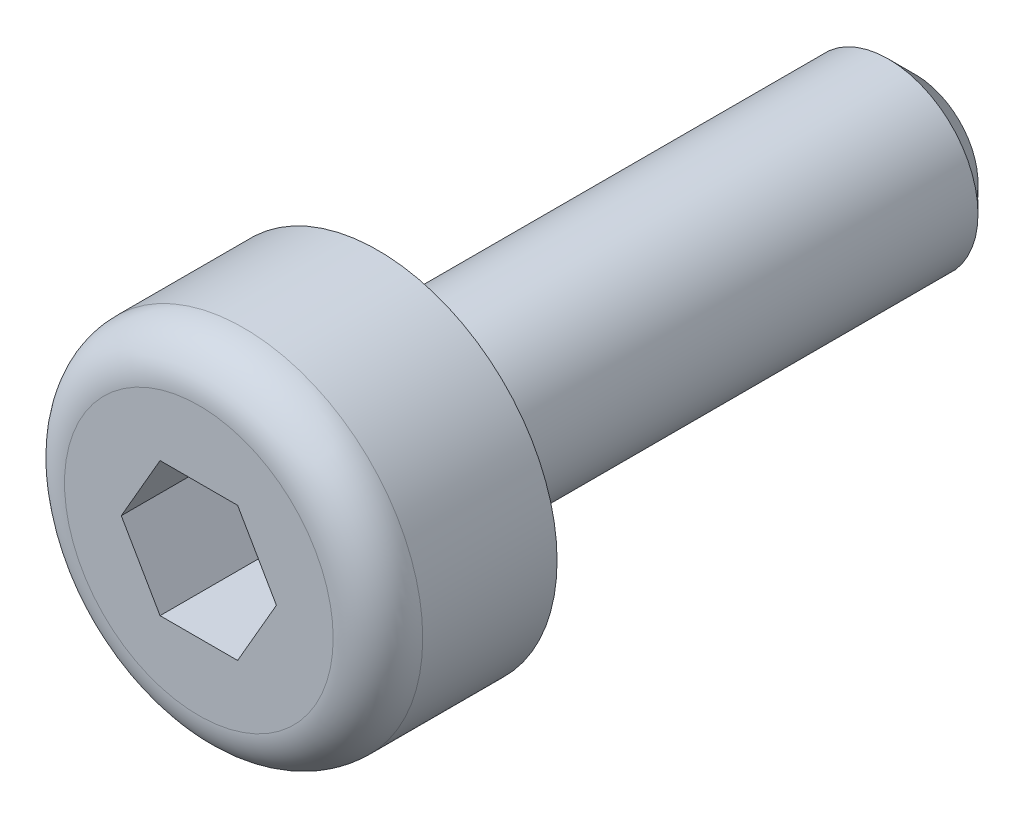
ISO-10303-21;
HEADER;
FILE_DESCRIPTION(('STEP AP214'),'2;1');
FILE_NAME('part.step','',(''),(''),'','','');
FILE_SCHEMA(('AUTOMOTIVE_DESIGN { 1 0 10303 214 1 1 1 1 }'));
ENDSEC;
DATA;
#1=APPLICATION_CONTEXT('core data for automotive mechanical design processes');
#2=APPLICATION_PROTOCOL_DEFINITION('international standard','automotive_design',2000,#1);
#3=PRODUCT_CONTEXT('',#1,'mechanical');
#4=PRODUCT('Part','Part','',(#3));
#5=PRODUCT_RELATED_PRODUCT_CATEGORY('part','',(#4));
#6=PRODUCT_DEFINITION_FORMATION('','',#4);
#7=PRODUCT_DEFINITION_CONTEXT('part definition',#1,'design');
#8=PRODUCT_DEFINITION('design','',#6,#7);
#9=PRODUCT_DEFINITION_SHAPE('','',#8);
#10=(LENGTH_UNIT() NAMED_UNIT(*) SI_UNIT(.MILLI.,.METRE.));
#11=(NAMED_UNIT(*) PLANE_ANGLE_UNIT() SI_UNIT($,.RADIAN.));
#12=(NAMED_UNIT(*) SI_UNIT($,.STERADIAN.) SOLID_ANGLE_UNIT());
#13=UNCERTAINTY_MEASURE_WITH_UNIT(LENGTH_MEASURE(1.E-05),#10,'distance_accuracy_value','');
#14=(GEOMETRIC_REPRESENTATION_CONTEXT(3) GLOBAL_UNCERTAINTY_ASSIGNED_CONTEXT((#13)) GLOBAL_UNIT_ASSIGNED_CONTEXT((#10,
#11,#12)) REPRESENTATION_CONTEXT('',''));
#15=CARTESIAN_POINT('',(0.,0.,0.));
#16=DIRECTION('',(0.,0.,1.));
#17=DIRECTION('',(1.,0.,0.));
#18=AXIS2_PLACEMENT_3D('',#15,#16,#17);
#19=CARTESIAN_POINT('',(0.,0.,0.));
#20=DIRECTION('',(0.,0.,1.));
#21=DIRECTION('',(1.,0.,0.));
#22=AXIS2_PLACEMENT_3D('',#19,#20,#21);
#23=PLANE('',#22);
#24=CARTESIAN_POINT('',(0.,0.,0.));
#25=DIRECTION('',(0.,0.,1.));
#26=DIRECTION('',(1.,0.,0.));
#27=AXIS2_PLACEMENT_3D('',#24,#25,#26);
#28=CIRCLE('',#27,2.);
#29=CARTESIAN_POINT('',(2.,0.,0.));
#30=VERTEX_POINT('',#29);
#31=EDGE_CURVE('E138',#30,#30,#28,.T.);
#32=ORIENTED_EDGE('',*,*,#31,.F.);
#33=EDGE_LOOP('',(#32));
#34=FACE_BOUND('',#33,.T.);
#35=CARTESIAN_POINT('',(0.,0.,0.));
#36=DIRECTION('',(0.,0.,1.));
#37=DIRECTION('',(1.,0.,0.));
#38=AXIS2_PLACEMENT_3D('',#35,#36,#37);
#39=CIRCLE('',#38,1.);
#40=CARTESIAN_POINT('',(1.,0.,0.));
#41=VERTEX_POINT('',#40);
#42=EDGE_CURVE('E146',#41,#41,#39,.F.);
#43=ORIENTED_EDGE('',*,*,#42,.F.);
#44=EDGE_LOOP('',(#43));
#45=FACE_BOUND('',#44,.T.);
#46=ADVANCED_FACE('F38',(#34,#45),#23,.F.);
#47=CARTESIAN_POINT('',(0.,0.,2.));
#48=DIRECTION('',(0.,0.,-1.));
#49=DIRECTION('',(-1.,0.,0.));
#50=AXIS2_PLACEMENT_3D('',#47,#48,#49);
#51=CYLINDRICAL_SURFACE('',#50,2.);
#52=CARTESIAN_POINT('',(0.,0.,1.5));
#53=DIRECTION('',(0.,0.,1.));
#54=DIRECTION('',(1.,0.,0.));
#55=AXIS2_PLACEMENT_3D('',#52,#53,#54);
#56=CIRCLE('',#55,2.);
#57=CARTESIAN_POINT('',(2.,0.,1.5));
#58=VERTEX_POINT('',#57);
#59=EDGE_CURVE('E11',#58,#58,#56,.F.);
#60=ORIENTED_EDGE('',*,*,#59,.T.);
#61=EDGE_LOOP('',(#60));
#62=FACE_BOUND('',#61,.T.);
#63=ORIENTED_EDGE('',*,*,#31,.T.);
#64=EDGE_LOOP('',(#63));
#65=FACE_BOUND('',#64,.T.);
#66=ADVANCED_FACE('F170',(#62,#65),#51,.T.);
#67=CARTESIAN_POINT('',(0.,0.,2.));
#68=DIRECTION('',(0.,0.,1.));
#69=DIRECTION('',(1.,0.,0.));
#70=AXIS2_PLACEMENT_3D('',#67,#68,#69);
#71=PLANE('',#70);
#72=CARTESIAN_POINT('',(0.,0.,2.));
#73=DIRECTION('',(0.,0.,1.));
#74=DIRECTION('',(1.,0.,0.));
#75=AXIS2_PLACEMENT_3D('',#72,#73,#74);
#76=CIRCLE('',#75,1.5);
#77=CARTESIAN_POINT('',(1.5,0.,2.));
#78=VERTEX_POINT('',#77);
#79=EDGE_CURVE('E46',#78,#78,#76,.T.);
#80=ORIENTED_EDGE('',*,*,#79,.T.);
#81=EDGE_LOOP('',(#80));
#82=FACE_BOUND('',#81,.T.);
#83=DIRECTION('',(-0.5,-0.866025403784439,0.));
#84=VECTOR('',#83,1.);
#85=CARTESIAN_POINT('',(-0.433012701892219,0.75,2.));
#86=LINE('',#85,#84);
#87=CARTESIAN_POINT('',(-0.433012701892219,0.75,2.));
#88=VERTEX_POINT('',#87);
#89=CARTESIAN_POINT('',(-0.866025403784438,0.,2.));
#90=VERTEX_POINT('',#89);
#91=EDGE_CURVE('E53',#88,#90,#86,.T.);
#92=ORIENTED_EDGE('',*,*,#91,.F.);
#93=DIRECTION('',(-1.,0.,0.));
#94=VECTOR('',#93,1.);
#95=CARTESIAN_POINT('',(0.43301270189222,0.75,2.));
#96=LINE('',#95,#94);
#97=CARTESIAN_POINT('',(0.43301270189222,0.75,2.));
#98=VERTEX_POINT('',#97);
#99=EDGE_CURVE('E134',#98,#88,#96,.T.);
#100=ORIENTED_EDGE('',*,*,#99,.F.);
#101=DIRECTION('',(-0.5,0.866025403784439,0.));
#102=VECTOR('',#101,1.);
#103=CARTESIAN_POINT('',(0.866025403784439,0.,2.));
#104=LINE('',#103,#102);
#105=CARTESIAN_POINT('',(0.866025403784439,0.,2.));
#106=VERTEX_POINT('',#105);
#107=EDGE_CURVE('E132',#106,#98,#104,.T.);
#108=ORIENTED_EDGE('',*,*,#107,.F.);
#109=DIRECTION('',(0.5,0.866025403784439,0.));
#110=VECTOR('',#109,1.);
#111=CARTESIAN_POINT('',(0.43301270189222,-0.75,2.));
#112=LINE('',#111,#110);
#113=CARTESIAN_POINT('',(0.43301270189222,-0.75,2.));
#114=VERTEX_POINT('',#113);
#115=EDGE_CURVE('E100',#114,#106,#112,.T.);
#116=ORIENTED_EDGE('',*,*,#115,.F.);
#117=DIRECTION('',(1.,0.,0.));
#118=VECTOR('',#117,1.);
#119=CARTESIAN_POINT('',(-0.43301270189222,-0.75,2.));
#120=LINE('',#119,#118);
#121=CARTESIAN_POINT('',(-0.43301270189222,-0.75,2.));
#122=VERTEX_POINT('',#121);
#123=EDGE_CURVE('E128',#122,#114,#120,.T.);
#124=ORIENTED_EDGE('',*,*,#123,.F.);
#125=DIRECTION('',(0.5,-0.866025403784439,0.));
#126=VECTOR('',#125,1.);
#127=CARTESIAN_POINT('',(-0.866025403784438,0.,2.));
#128=LINE('',#127,#126);
#129=EDGE_CURVE('E125',#90,#122,#128,.T.);
#130=ORIENTED_EDGE('',*,*,#129,.F.);
#131=EDGE_LOOP('',(#92,#100,#108,#116,#124,#130));
#132=FACE_BOUND('',#131,.T.);
#133=ADVANCED_FACE('F157',(#82,#132),#71,.T.);
#134=CARTESIAN_POINT('',(-0.433012701892219,0.75,0.));
#135=DIRECTION('',(-0.866025403784439,0.5,0.));
#136=DIRECTION('',(-0.5,-0.866025403784439,0.));
#137=AXIS2_PLACEMENT_3D('',#134,#135,#136);
#138=PLANE('',#137);
#139=ORIENTED_EDGE('',*,*,#91,.T.);
#140=DIRECTION('',(0.,0.,1.));
#141=VECTOR('',#140,1.);
#142=CARTESIAN_POINT('',(-0.866025403784438,0.,0.));
#143=LINE('',#142,#141);
#144=CARTESIAN_POINT('',(-0.866025403784438,0.,0.));
#145=VERTEX_POINT('',#144);
#146=EDGE_CURVE('E84',#145,#90,#143,.T.);
#147=ORIENTED_EDGE('',*,*,#146,.F.);
#148=DIRECTION('',(-0.5,-0.866025403784439,0.));
#149=VECTOR('',#148,1.);
#150=CARTESIAN_POINT('',(-0.433012701892219,0.75,0.));
#151=LINE('',#150,#149);
#152=CARTESIAN_POINT('',(-0.433012701892219,0.75,0.));
#153=VERTEX_POINT('',#152);
#154=EDGE_CURVE('E136',#153,#145,#151,.T.);
#155=ORIENTED_EDGE('',*,*,#154,.F.);
#156=DIRECTION('',(0.,0.,1.));
#157=VECTOR('',#156,1.);
#158=CARTESIAN_POINT('',(-0.433012701892219,0.75,0.));
#159=LINE('',#158,#157);
#160=EDGE_CURVE('E61',#153,#88,#159,.T.);
#161=ORIENTED_EDGE('',*,*,#160,.T.);
#162=EDGE_LOOP('',(#139,#147,#155,#161));
#163=FACE_BOUND('',#162,.T.);
#164=ADVANCED_FACE('F183',(#163),#138,.F.);
#165=CARTESIAN_POINT('',(0.43301270189222,0.75,0.));
#166=DIRECTION('',(0.,1.,0.));
#167=DIRECTION('',(0.,0.,1.));
#168=AXIS2_PLACEMENT_3D('',#165,#166,#167);
#169=PLANE('',#168);
#170=ORIENTED_EDGE('',*,*,#99,.T.);
#171=ORIENTED_EDGE('',*,*,#160,.F.);
#172=DIRECTION('',(-1.,0.,0.));
#173=VECTOR('',#172,1.);
#174=CARTESIAN_POINT('',(0.43301270189222,0.75,0.));
#175=LINE('',#174,#173);
#176=CARTESIAN_POINT('',(0.43301270189222,0.75,0.));
#177=VERTEX_POINT('',#176);
#178=EDGE_CURVE('E112',#177,#153,#175,.T.);
#179=ORIENTED_EDGE('',*,*,#178,.F.);
#180=DIRECTION('',(0.,0.,1.));
#181=VECTOR('',#180,1.);
#182=CARTESIAN_POINT('',(0.43301270189222,0.75,0.));
#183=LINE('',#182,#181);
#184=EDGE_CURVE('E104',#177,#98,#183,.T.);
#185=ORIENTED_EDGE('',*,*,#184,.T.);
#186=EDGE_LOOP('',(#170,#171,#179,#185));
#187=FACE_BOUND('',#186,.T.);
#188=ADVANCED_FACE('F186',(#187),#169,.F.);
#189=CARTESIAN_POINT('',(0.866025403784439,0.,0.));
#190=DIRECTION('',(0.866025403784439,0.5,0.));
#191=DIRECTION('',(-0.5,0.866025403784439,0.));
#192=AXIS2_PLACEMENT_3D('',#189,#190,#191);
#193=PLANE('',#192);
#194=ORIENTED_EDGE('',*,*,#107,.T.);
#195=ORIENTED_EDGE('',*,*,#184,.F.);
#196=DIRECTION('',(-0.5,0.866025403784439,0.));
#197=VECTOR('',#196,1.);
#198=CARTESIAN_POINT('',(0.866025403784439,0.,0.));
#199=LINE('',#198,#197);
#200=CARTESIAN_POINT('',(0.866025403784439,0.,0.));
#201=VERTEX_POINT('',#200);
#202=EDGE_CURVE('E108',#201,#177,#199,.T.);
#203=ORIENTED_EDGE('',*,*,#202,.F.);
#204=DIRECTION('',(0.,0.,1.));
#205=VECTOR('',#204,1.);
#206=CARTESIAN_POINT('',(0.866025403784439,0.,0.));
#207=LINE('',#206,#205);
#208=EDGE_CURVE('E93',#201,#106,#207,.T.);
#209=ORIENTED_EDGE('',*,*,#208,.T.);
#210=EDGE_LOOP('',(#194,#195,#203,#209));
#211=FACE_BOUND('',#210,.T.);
#212=ADVANCED_FACE('F109',(#211),#193,.F.);
#213=CARTESIAN_POINT('',(0.43301270189222,-0.75,0.));
#214=DIRECTION('',(0.866025403784439,-0.5,0.));
#215=DIRECTION('',(0.5,0.866025403784439,0.));
#216=AXIS2_PLACEMENT_3D('',#213,#214,#215);
#217=PLANE('',#216);
#218=ORIENTED_EDGE('',*,*,#115,.T.);
#219=ORIENTED_EDGE('',*,*,#208,.F.);
#220=DIRECTION('',(0.5,0.866025403784439,0.));
#221=VECTOR('',#220,1.);
#222=CARTESIAN_POINT('',(0.43301270189222,-0.75,0.));
#223=LINE('',#222,#221);
#224=CARTESIAN_POINT('',(0.43301270189222,-0.75,0.));
#225=VERTEX_POINT('',#224);
#226=EDGE_CURVE('E97',#225,#201,#223,.T.);
#227=ORIENTED_EDGE('',*,*,#226,.F.);
#228=DIRECTION('',(0.,0.,1.));
#229=VECTOR('',#228,1.);
#230=CARTESIAN_POINT('',(0.43301270189222,-0.75,0.));
#231=LINE('',#230,#229);
#232=EDGE_CURVE('E105',#225,#114,#231,.T.);
#233=ORIENTED_EDGE('',*,*,#232,.T.);
#234=EDGE_LOOP('',(#218,#219,#227,#233));
#235=FACE_BOUND('',#234,.T.);
#236=ADVANCED_FACE('F95',(#235),#217,.F.);
#237=CARTESIAN_POINT('',(-0.43301270189222,-0.75,0.));
#238=DIRECTION('',(0.,-1.,0.));
#239=DIRECTION('',(1.,0.,0.));
#240=AXIS2_PLACEMENT_3D('',#237,#238,#239);
#241=PLANE('',#240);
#242=ORIENTED_EDGE('',*,*,#123,.T.);
#243=ORIENTED_EDGE('',*,*,#232,.F.);
#244=DIRECTION('',(1.,0.,0.));
#245=VECTOR('',#244,1.);
#246=CARTESIAN_POINT('',(-0.43301270189222,-0.75,0.));
#247=LINE('',#246,#245);
#248=CARTESIAN_POINT('',(-0.43301270189222,-0.75,0.));
#249=VERTEX_POINT('',#248);
#250=EDGE_CURVE('E117',#249,#225,#247,.T.);
#251=ORIENTED_EDGE('',*,*,#250,.F.);
#252=DIRECTION('',(0.,0.,1.));
#253=VECTOR('',#252,1.);
#254=CARTESIAN_POINT('',(-0.43301270189222,-0.75,0.));
#255=LINE('',#254,#253);
#256=EDGE_CURVE('E141',#249,#122,#255,.T.);
#257=ORIENTED_EDGE('',*,*,#256,.T.);
#258=EDGE_LOOP('',(#242,#243,#251,#257));
#259=FACE_BOUND('',#258,.T.);
#260=ADVANCED_FACE('F190',(#259),#241,.F.);
#261=CARTESIAN_POINT('',(-0.866025403784438,0.,0.));
#262=DIRECTION('',(-0.866025403784439,-0.5,0.));
#263=DIRECTION('',(0.5,-0.866025403784439,0.));
#264=AXIS2_PLACEMENT_3D('',#261,#262,#263);
#265=PLANE('',#264);
#266=ORIENTED_EDGE('',*,*,#129,.T.);
#267=ORIENTED_EDGE('',*,*,#256,.F.);
#268=DIRECTION('',(0.5,-0.866025403784439,0.));
#269=VECTOR('',#268,1.);
#270=CARTESIAN_POINT('',(-0.866025403784438,0.,0.));
#271=LINE('',#270,#269);
#272=EDGE_CURVE('E119',#145,#249,#271,.T.);
#273=ORIENTED_EDGE('',*,*,#272,.F.);
#274=ORIENTED_EDGE('',*,*,#146,.T.);
#275=EDGE_LOOP('',(#266,#267,#273,#274));
#276=FACE_BOUND('',#275,.T.);
#277=ADVANCED_FACE('F187',(#276),#265,.F.);
#278=CARTESIAN_POINT('',(0.,0.,0.));
#279=DIRECTION('',(0.,0.,-1.));
#280=DIRECTION('',(-1.,0.,0.));
#281=AXIS2_PLACEMENT_3D('',#278,#279,#280);
#282=PLANE('',#281);
#283=ORIENTED_EDGE('',*,*,#178,.T.);
#284=ORIENTED_EDGE('',*,*,#154,.T.);
#285=ORIENTED_EDGE('',*,*,#272,.T.);
#286=ORIENTED_EDGE('',*,*,#250,.T.);
#287=ORIENTED_EDGE('',*,*,#226,.T.);
#288=ORIENTED_EDGE('',*,*,#202,.T.);
#289=EDGE_LOOP('',(#283,#284,#285,#286,#287,#288));
#290=FACE_BOUND('',#289,.T.);
#291=ADVANCED_FACE('F114',(#290),#282,.F.);
#292=CARTESIAN_POINT('',(0.,0.,-6.));
#293=DIRECTION('',(0.,0.,1.));
#294=DIRECTION('',(1.,0.,0.));
#295=AXIS2_PLACEMENT_3D('',#292,#293,#294);
#296=CYLINDRICAL_SURFACE('',#295,1.);
#297=CARTESIAN_POINT('',(0.,0.,-5.7));
#298=DIRECTION('',(0.,0.,-1.));
#299=DIRECTION('',(-1.,0.,0.));
#300=AXIS2_PLACEMENT_3D('',#297,#298,#299);
#301=CIRCLE('',#300,1.);
#302=CARTESIAN_POINT('',(-1.,0.,-5.7));
#303=VERTEX_POINT('',#302);
#304=EDGE_CURVE('E152',#303,#303,#301,.F.);
#305=ORIENTED_EDGE('',*,*,#304,.T.);
#306=EDGE_LOOP('',(#305));
#307=FACE_BOUND('',#306,.T.);
#308=ORIENTED_EDGE('',*,*,#42,.T.);
#309=EDGE_LOOP('',(#308));
#310=FACE_BOUND('',#309,.T.);
#311=ADVANCED_FACE('F201',(#307,#310),#296,.T.);
#312=CARTESIAN_POINT('',(0.,0.,-6.));
#313=DIRECTION('',(0.,0.,-1.));
#314=DIRECTION('',(-1.,0.,0.));
#315=AXIS2_PLACEMENT_3D('',#312,#313,#314);
#316=PLANE('',#315);
#317=CARTESIAN_POINT('',(0.,0.,-6.));
#318=DIRECTION('',(0.,0.,-1.));
#319=DIRECTION('',(-1.,0.,0.));
#320=AXIS2_PLACEMENT_3D('',#317,#318,#319);
#321=CIRCLE('',#320,0.699999999999998);
#322=CARTESIAN_POINT('',(-0.699999999999998,0.,-6.));
#323=VERTEX_POINT('',#322);
#324=EDGE_CURVE('E149',#323,#323,#321,.T.);
#325=ORIENTED_EDGE('',*,*,#324,.T.);
#326=EDGE_LOOP('',(#325));
#327=FACE_BOUND('',#326,.T.);
#328=ADVANCED_FACE('F166',(#327),#316,.T.);
#329=CARTESIAN_POINT('',(0.,0.,-6.));
#330=DIRECTION('',(0.,0.,1.));
#331=DIRECTION('',(1.,0.,0.));
#332=AXIS2_PLACEMENT_3D('',#329,#330,#331);
#333=CONICAL_SURFACE('',#332,0.699999999999998,0.785398163397448);
#334=ORIENTED_EDGE('',*,*,#304,.F.);
#335=EDGE_LOOP('',(#334));
#336=FACE_BOUND('',#335,.T.);
#337=ORIENTED_EDGE('',*,*,#324,.F.);
#338=EDGE_LOOP('',(#337));
#339=FACE_BOUND('',#338,.T.);
#340=ADVANCED_FACE('F161',(#336,#339),#333,.T.);
#341=CARTESIAN_POINT('',(0.,0.,1.5));
#342=DIRECTION('',(0.,0.,1.));
#343=DIRECTION('',(1.,0.,0.));
#344=AXIS2_PLACEMENT_3D('',#341,#342,#343);
#345=TOROIDAL_SURFACE('',#344,1.5,0.5);
#346=ORIENTED_EDGE('',*,*,#59,.F.);
#347=EDGE_LOOP('',(#346));
#348=FACE_BOUND('',#347,.T.);
#349=ORIENTED_EDGE('',*,*,#79,.F.);
#350=EDGE_LOOP('',(#349));
#351=FACE_BOUND('',#350,.T.);
#352=ADVANCED_FACE('F40',(#348,#351),#345,.T.);
#353=CLOSED_SHELL('',(#46,#66,#133,#164,#188,#212,#236,#260,#277,#291,#311,#328,#340,#352));
#354=MANIFOLD_SOLID_BREP('B2',#353);
#355=ADVANCED_BREP_SHAPE_REPRESENTATION('',(#18,#354),#14);
#356=SHAPE_DEFINITION_REPRESENTATION(#9,#355);
ENDSEC;
END-ISO-10303-21;
